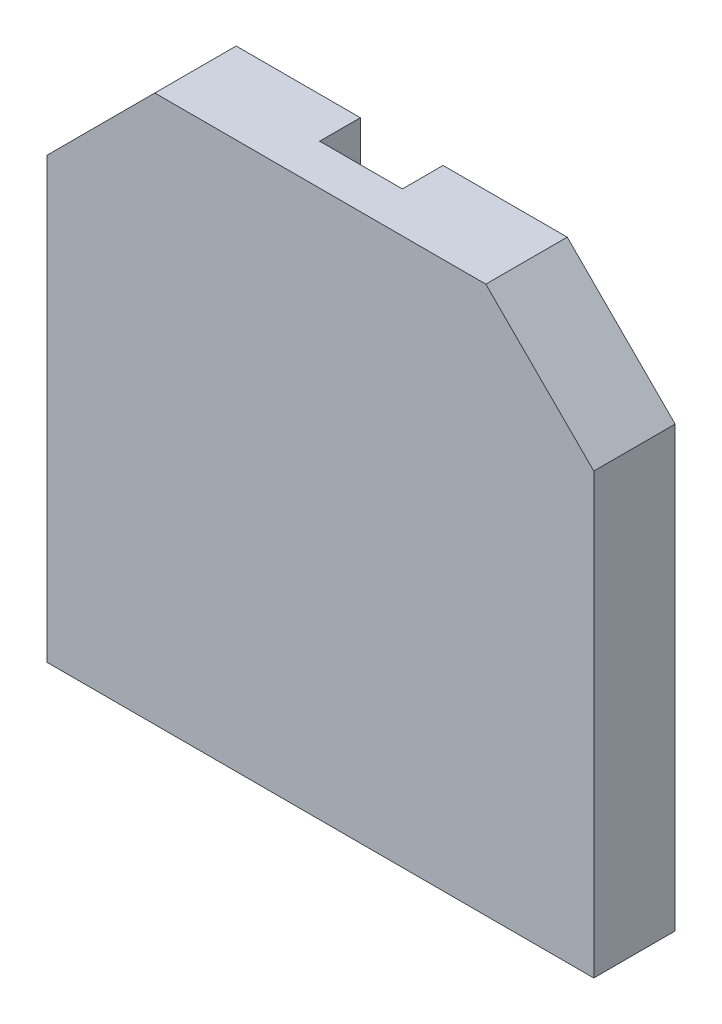
ISO-10303-21;
HEADER;
FILE_DESCRIPTION(('STEP AP214'),'2;1');
FILE_NAME('part.step','',(''),(''),'','','');
FILE_SCHEMA(('AUTOMOTIVE_DESIGN { 1 0 10303 214 1 1 1 1 }'));
ENDSEC;
DATA;
#1=APPLICATION_CONTEXT('core data for automotive mechanical design processes');
#2=APPLICATION_PROTOCOL_DEFINITION('international standard','automotive_design',2000,#1);
#3=PRODUCT_CONTEXT('',#1,'mechanical');
#4=PRODUCT('Part','Part','',(#3));
#5=PRODUCT_RELATED_PRODUCT_CATEGORY('part','',(#4));
#6=PRODUCT_DEFINITION_FORMATION('','',#4);
#7=PRODUCT_DEFINITION_CONTEXT('part definition',#1,'design');
#8=PRODUCT_DEFINITION('design','',#6,#7);
#9=PRODUCT_DEFINITION_SHAPE('','',#8);
#10=(LENGTH_UNIT() NAMED_UNIT(*) SI_UNIT(.MILLI.,.METRE.));
#11=(NAMED_UNIT(*) PLANE_ANGLE_UNIT() SI_UNIT($,.RADIAN.));
#12=(NAMED_UNIT(*) SI_UNIT($,.STERADIAN.) SOLID_ANGLE_UNIT());
#13=UNCERTAINTY_MEASURE_WITH_UNIT(LENGTH_MEASURE(1.E-05),#10,'distance_accuracy_value','');
#14=(GEOMETRIC_REPRESENTATION_CONTEXT(3) GLOBAL_UNCERTAINTY_ASSIGNED_CONTEXT((#13)) GLOBAL_UNIT_ASSIGNED_CONTEXT((#10,
#11,#12)) REPRESENTATION_CONTEXT('',''));
#15=CARTESIAN_POINT('',(0.,0.,0.));
#16=DIRECTION('',(0.,0.,1.));
#17=DIRECTION('',(1.,0.,0.));
#18=AXIS2_PLACEMENT_3D('',#15,#16,#17);
#19=CARTESIAN_POINT('',(-0.32500062,0.45719746,0.31999936));
#20=DIRECTION('',(0.,0.,-1.));
#21=DIRECTION('',(-1.,0.,0.));
#22=AXIS2_PLACEMENT_3D('',#19,#20,#21);
#23=PLANE('',#22);
#24=DIRECTION('',(0.,1.,0.));
#25=VECTOR('',#24,1.);
#26=CARTESIAN_POINT('',(0.32500062,-1.33862826,0.31999936));
#27=LINE('',#26,#25);
#28=CARTESIAN_POINT('',(0.32500062,-1.33862826,0.31999936));
#29=VERTEX_POINT('',#28);
#30=CARTESIAN_POINT('',(0.32500062,0.30719776,0.31999936));
#31=VERTEX_POINT('',#30);
#32=EDGE_CURVE('E153',#29,#31,#27,.T.);
#33=ORIENTED_EDGE('',*,*,#32,.F.);
#34=DIRECTION('',(1.,0.,0.));
#35=VECTOR('',#34,1.);
#36=CARTESIAN_POINT('',(-0.32500062,-1.33862826,0.31999936));
#37=LINE('',#36,#35);
#38=CARTESIAN_POINT('',(-0.32500062,-1.33862826,0.31999936));
#39=VERTEX_POINT('',#38);
#40=EDGE_CURVE('E151',#39,#29,#37,.T.);
#41=ORIENTED_EDGE('',*,*,#40,.F.);
#42=DIRECTION('',(0.,1.,0.));
#43=VECTOR('',#42,1.);
#44=CARTESIAN_POINT('',(-0.32500062,0.45719746,0.31999936));
#45=LINE('',#44,#43);
#46=CARTESIAN_POINT('',(-0.32500062,0.30719776,0.31999936));
#47=VERTEX_POINT('',#46);
#48=EDGE_CURVE('E146',#47,#39,#45,.F.);
#49=ORIENTED_EDGE('',*,*,#48,.F.);
#50=DIRECTION('',(-1.,0.,0.));
#51=VECTOR('',#50,1.);
#52=CARTESIAN_POINT('',(-0.32500062,0.30719776,0.31999936));
#53=LINE('',#52,#51);
#54=EDGE_CURVE('E19',#47,#31,#53,.F.);
#55=ORIENTED_EDGE('',*,*,#54,.T.);
#56=EDGE_LOOP('',(#33,#41,#49,#55));
#57=FACE_BOUND('',#56,.T.);
#58=ADVANCED_FACE('F16',(#57),#23,.T.);
#59=CARTESIAN_POINT('',(-0.32500062,-2.34697524,0.31999936));
#60=DIRECTION('',(0.,0.,-1.));
#61=DIRECTION('',(-1.,0.,0.));
#62=AXIS2_PLACEMENT_3D('',#59,#60,#61);
#63=PLANE('',#62);
#64=DIRECTION('',(0.,1.,0.));
#65=VECTOR('',#64,1.);
#66=CARTESIAN_POINT('',(-0.32500062,-2.34697524,0.31999936));
#67=LINE('',#66,#65);
#68=CARTESIAN_POINT('',(-0.32500062,-2.34697524,0.31999936));
#69=VERTEX_POINT('',#68);
#70=CARTESIAN_POINT('',(-0.32500062,-3.9928038,0.31999936));
#71=VERTEX_POINT('',#70);
#72=EDGE_CURVE('E125',#69,#71,#67,.F.);
#73=ORIENTED_EDGE('',*,*,#72,.F.);
#74=DIRECTION('',(1.,0.,0.));
#75=VECTOR('',#74,1.);
#76=CARTESIAN_POINT('',(0.32500062,-2.34697524,0.31999936));
#77=LINE('',#76,#75);
#78=CARTESIAN_POINT('',(0.32500062,-2.34697524,0.31999936));
#79=VERTEX_POINT('',#78);
#80=EDGE_CURVE('E115',#79,#69,#77,.F.);
#81=ORIENTED_EDGE('',*,*,#80,.F.);
#82=DIRECTION('',(0.,1.,0.));
#83=VECTOR('',#82,1.);
#84=CARTESIAN_POINT('',(0.32500062,-4.14280096,0.31999936));
#85=LINE('',#84,#83);
#86=CARTESIAN_POINT('',(0.32500062,-3.9928038,0.31999936));
#87=VERTEX_POINT('',#86);
#88=EDGE_CURVE('E126',#87,#79,#85,.T.);
#89=ORIENTED_EDGE('',*,*,#88,.F.);
#90=DIRECTION('',(-1.,0.,0.));
#91=VECTOR('',#90,1.);
#92=CARTESIAN_POINT('',(-0.32500062,-3.9928038,0.31999936));
#93=LINE('',#92,#91);
#94=EDGE_CURVE('E122',#87,#71,#93,.T.);
#95=ORIENTED_EDGE('',*,*,#94,.T.);
#96=EDGE_LOOP('',(#73,#81,#89,#95));
#97=FACE_BOUND('',#96,.T.);
#98=ADVANCED_FACE('F124',(#97),#63,.T.);
#99=CARTESIAN_POINT('',(0.32500062,-2.34697524,-1.00000054));
#100=DIRECTION('',(0.,-1.,0.));
#101=DIRECTION('',(0.,0.,-1.));
#102=AXIS2_PLACEMENT_3D('',#99,#100,#101);
#103=PLANE('',#102);
#104=ORIENTED_EDGE('',*,*,#80,.T.);
#105=DIRECTION('',(0.,0.,-1.));
#106=VECTOR('',#105,1.);
#107=CARTESIAN_POINT('',(-0.32500062,-2.34697524,-1.00000054));
#108=LINE('',#107,#106);
#109=CARTESIAN_POINT('',(-0.32500062,-2.34697524,0.));
#110=VERTEX_POINT('',#109);
#111=EDGE_CURVE('E134',#110,#69,#108,.F.);
#112=ORIENTED_EDGE('',*,*,#111,.F.);
#113=DIRECTION('',(-1.,0.,0.));
#114=VECTOR('',#113,1.);
#115=CARTESIAN_POINT('',(-2.15000078,-2.34697524,0.));
#116=LINE('',#115,#114);
#117=CARTESIAN_POINT('',(0.32500062,-2.34697524,0.));
#118=VERTEX_POINT('',#117);
#119=EDGE_CURVE('E166',#118,#110,#116,.T.);
#120=ORIENTED_EDGE('',*,*,#119,.F.);
#121=DIRECTION('',(0.,0.,1.));
#122=VECTOR('',#121,1.);
#123=CARTESIAN_POINT('',(0.32500062,-2.34697524,-1.00000054));
#124=LINE('',#123,#122);
#125=EDGE_CURVE('E164',#79,#118,#124,.F.);
#126=ORIENTED_EDGE('',*,*,#125,.F.);
#127=EDGE_LOOP('',(#104,#112,#120,#126));
#128=FACE_BOUND('',#127,.T.);
#129=ADVANCED_FACE('F287',(#128),#103,.T.);
#130=CARTESIAN_POINT('',(-0.32500062,-2.34697524,-1.00000054));
#131=DIRECTION('',(1.,0.,0.));
#132=DIRECTION('',(0.,0.,-1.));
#133=AXIS2_PLACEMENT_3D('',#130,#131,#132);
#134=PLANE('',#133);
#135=DIRECTION('',(0.,1.,0.));
#136=VECTOR('',#135,1.);
#137=CARTESIAN_POINT('',(-0.32500062,-0.54133242,0.));
#138=LINE('',#137,#136);
#139=CARTESIAN_POINT('',(-0.32500062,-3.9928038,0.));
#140=VERTEX_POINT('',#139);
#141=EDGE_CURVE('E168',#110,#140,#138,.F.);
#142=ORIENTED_EDGE('',*,*,#141,.F.);
#143=ORIENTED_EDGE('',*,*,#111,.T.);
#144=ORIENTED_EDGE('',*,*,#72,.T.);
#145=DIRECTION('',(0.,0.,-1.));
#146=VECTOR('',#145,1.);
#147=CARTESIAN_POINT('',(-0.32500062,-3.9928038,-1.00000054));
#148=LINE('',#147,#146);
#149=EDGE_CURVE('E132',#71,#140,#148,.T.);
#150=ORIENTED_EDGE('',*,*,#149,.T.);
#151=EDGE_LOOP('',(#142,#143,#144,#150));
#152=FACE_BOUND('',#151,.T.);
#153=ADVANCED_FACE('F131',(#152),#134,.T.);
#154=CARTESIAN_POINT('',(-0.32500062,0.45719746,-1.00000054));
#155=DIRECTION('',(1.,0.,0.));
#156=DIRECTION('',(0.,0.,-1.));
#157=AXIS2_PLACEMENT_3D('',#154,#155,#156);
#158=PLANE('',#157);
#159=ORIENTED_EDGE('',*,*,#48,.T.);
#160=DIRECTION('',(0.,0.,1.));
#161=VECTOR('',#160,1.);
#162=CARTESIAN_POINT('',(-0.32500062,-1.33862826,-1.00000054));
#163=LINE('',#162,#161);
#164=CARTESIAN_POINT('',(-0.32500062,-1.33862826,0.));
#165=VERTEX_POINT('',#164);
#166=EDGE_CURVE('E148',#165,#39,#163,.T.);
#167=ORIENTED_EDGE('',*,*,#166,.F.);
#168=DIRECTION('',(0.,1.,0.));
#169=VECTOR('',#168,1.);
#170=CARTESIAN_POINT('',(-0.32500062,-0.54133242,0.));
#171=LINE('',#170,#169);
#172=CARTESIAN_POINT('',(-0.32500062,0.30719776,0.));
#173=VERTEX_POINT('',#172);
#174=EDGE_CURVE('E170',#173,#165,#171,.F.);
#175=ORIENTED_EDGE('',*,*,#174,.F.);
#176=DIRECTION('',(0.,0.,-1.));
#177=VECTOR('',#176,1.);
#178=CARTESIAN_POINT('',(-0.32500062,0.30719776,-1.00000054));
#179=LINE('',#178,#177);
#180=EDGE_CURVE('E141',#173,#47,#179,.F.);
#181=ORIENTED_EDGE('',*,*,#180,.T.);
#182=EDGE_LOOP('',(#159,#167,#175,#181));
#183=FACE_BOUND('',#182,.T.);
#184=ADVANCED_FACE('F280',(#183),#158,.T.);
#185=CARTESIAN_POINT('',(-0.32500062,-1.33862826,-1.00000054));
#186=DIRECTION('',(0.,1.,0.));
#187=DIRECTION('',(0.,0.,1.));
#188=AXIS2_PLACEMENT_3D('',#185,#186,#187);
#189=PLANE('',#188);
#190=ORIENTED_EDGE('',*,*,#40,.T.);
#191=DIRECTION('',(0.,0.,1.));
#192=VECTOR('',#191,1.);
#193=CARTESIAN_POINT('',(0.32500062,-1.33862826,-1.00000054));
#194=LINE('',#193,#192);
#195=CARTESIAN_POINT('',(0.32500062,-1.33862826,0.));
#196=VERTEX_POINT('',#195);
#197=EDGE_CURVE('E158',#196,#29,#194,.T.);
#198=ORIENTED_EDGE('',*,*,#197,.F.);
#199=DIRECTION('',(-1.,0.,0.));
#200=VECTOR('',#199,1.);
#201=CARTESIAN_POINT('',(-2.15000078,-1.33862826,0.));
#202=LINE('',#201,#200);
#203=EDGE_CURVE('E172',#165,#196,#202,.F.);
#204=ORIENTED_EDGE('',*,*,#203,.F.);
#205=ORIENTED_EDGE('',*,*,#166,.T.);
#206=EDGE_LOOP('',(#190,#198,#204,#205));
#207=FACE_BOUND('',#206,.T.);
#208=ADVANCED_FACE('F276',(#207),#189,.T.);
#209=CARTESIAN_POINT('',(0.32500062,-1.33862826,-1.00000054));
#210=DIRECTION('',(-1.,0.,0.));
#211=DIRECTION('',(0.,0.,1.));
#212=AXIS2_PLACEMENT_3D('',#209,#210,#211);
#213=PLANE('',#212);
#214=DIRECTION('',(0.,1.,0.));
#215=VECTOR('',#214,1.);
#216=CARTESIAN_POINT('',(0.32500062,-0.54133242,0.));
#217=LINE('',#216,#215);
#218=CARTESIAN_POINT('',(0.32500062,0.30719776,0.));
#219=VERTEX_POINT('',#218);
#220=EDGE_CURVE('E174',#196,#219,#217,.T.);
#221=ORIENTED_EDGE('',*,*,#220,.F.);
#222=ORIENTED_EDGE('',*,*,#197,.T.);
#223=ORIENTED_EDGE('',*,*,#32,.T.);
#224=DIRECTION('',(0.,0.,1.));
#225=VECTOR('',#224,1.);
#226=CARTESIAN_POINT('',(0.32500062,0.30719776,-1.00000054));
#227=LINE('',#226,#225);
#228=EDGE_CURVE('E156',#31,#219,#227,.F.);
#229=ORIENTED_EDGE('',*,*,#228,.T.);
#230=EDGE_LOOP('',(#221,#222,#223,#229));
#231=FACE_BOUND('',#230,.T.);
#232=ADVANCED_FACE('F272',(#231),#213,.T.);
#233=CARTESIAN_POINT('',(0.32500062,-4.14280096,-1.00000054));
#234=DIRECTION('',(-1.,0.,0.));
#235=DIRECTION('',(0.,0.,1.));
#236=AXIS2_PLACEMENT_3D('',#233,#234,#235);
#237=PLANE('',#236);
#238=ORIENTED_EDGE('',*,*,#88,.T.);
#239=ORIENTED_EDGE('',*,*,#125,.T.);
#240=DIRECTION('',(0.,1.,0.));
#241=VECTOR('',#240,1.);
#242=CARTESIAN_POINT('',(0.32500062,-0.54133242,0.));
#243=LINE('',#242,#241);
#244=CARTESIAN_POINT('',(0.32500062,-3.9928038,0.));
#245=VERTEX_POINT('',#244);
#246=EDGE_CURVE('E177',#245,#118,#243,.T.);
#247=ORIENTED_EDGE('',*,*,#246,.F.);
#248=DIRECTION('',(0.,0.,1.));
#249=VECTOR('',#248,1.);
#250=CARTESIAN_POINT('',(0.32500062,-3.9928038,-1.00000054));
#251=LINE('',#250,#249);
#252=EDGE_CURVE('E161',#245,#87,#251,.T.);
#253=ORIENTED_EDGE('',*,*,#252,.T.);
#254=EDGE_LOOP('',(#238,#239,#247,#253));
#255=FACE_BOUND('',#254,.T.);
#256=ADVANCED_FACE('F268',(#255),#237,.T.);
#257=CARTESIAN_POINT('',(-2.15000078,-0.54133242,0.));
#258=DIRECTION('',(0.,0.,-1.));
#259=DIRECTION('',(-1.,0.,0.));
#260=AXIS2_PLACEMENT_3D('',#257,#258,#259);
#261=PLANE('',#260);
#262=DIRECTION('',(1.,0.,0.));
#263=VECTOR('',#262,1.);
#264=CARTESIAN_POINT('',(-2.15000078,-3.9928038,0.));
#265=LINE('',#264,#263);
#266=CARTESIAN_POINT('',(2.15000078,-3.9928038,0.));
#267=VERTEX_POINT('',#266);
#268=EDGE_CURVE('E205',#267,#245,#265,.F.);
#269=ORIENTED_EDGE('',*,*,#268,.T.);
#270=ORIENTED_EDGE('',*,*,#246,.T.);
#271=ORIENTED_EDGE('',*,*,#119,.T.);
#272=ORIENTED_EDGE('',*,*,#141,.T.);
#273=DIRECTION('',(1.,0.,0.));
#274=VECTOR('',#273,1.);
#275=CARTESIAN_POINT('',(-2.15000078,-3.9928038,0.));
#276=LINE('',#275,#274);
#277=CARTESIAN_POINT('',(-2.15000078,-3.9928038,0.));
#278=VERTEX_POINT('',#277);
#279=EDGE_CURVE('E139',#140,#278,#276,.F.);
#280=ORIENTED_EDGE('',*,*,#279,.T.);
#281=DIRECTION('',(0.,1.,0.));
#282=VECTOR('',#281,1.);
#283=CARTESIAN_POINT('',(-2.15000078,-0.54133242,0.));
#284=LINE('',#283,#282);
#285=CARTESIAN_POINT('',(-2.15000078,-0.54133242,0.));
#286=VERTEX_POINT('',#285);
#287=EDGE_CURVE('E212',#278,#286,#284,.T.);
#288=ORIENTED_EDGE('',*,*,#287,.T.);
#289=DIRECTION('',(0.707106781186548,0.707106781186548,0.));
#290=VECTOR('',#289,1.);
#291=CARTESIAN_POINT('',(-1.3014706,0.30719776,0.));
#292=LINE('',#291,#290);
#293=CARTESIAN_POINT('',(-1.3014706,0.30719776,0.));
#294=VERTEX_POINT('',#293);
#295=EDGE_CURVE('E180',#286,#294,#292,.T.);
#296=ORIENTED_EDGE('',*,*,#295,.T.);
#297=DIRECTION('',(1.,0.,0.));
#298=VECTOR('',#297,1.);
#299=CARTESIAN_POINT('',(1.3014706,0.30719776,0.));
#300=LINE('',#299,#298);
#301=EDGE_CURVE('E183',#294,#173,#300,.T.);
#302=ORIENTED_EDGE('',*,*,#301,.T.);
#303=ORIENTED_EDGE('',*,*,#174,.T.);
#304=ORIENTED_EDGE('',*,*,#203,.T.);
#305=ORIENTED_EDGE('',*,*,#220,.T.);
#306=DIRECTION('',(1.,0.,0.));
#307=VECTOR('',#306,1.);
#308=CARTESIAN_POINT('',(1.3014706,0.30719776,0.));
#309=LINE('',#308,#307);
#310=CARTESIAN_POINT('',(1.3014706,0.30719776,0.));
#311=VERTEX_POINT('',#310);
#312=EDGE_CURVE('E186',#219,#311,#309,.T.);
#313=ORIENTED_EDGE('',*,*,#312,.T.);
#314=DIRECTION('',(0.707106781186548,-0.707106781186548,0.));
#315=VECTOR('',#314,1.);
#316=CARTESIAN_POINT('',(2.15000078,-0.54133242,0.));
#317=LINE('',#316,#315);
#318=CARTESIAN_POINT('',(2.15000078,-0.54133242,0.));
#319=VERTEX_POINT('',#318);
#320=EDGE_CURVE('E194',#311,#319,#317,.T.);
#321=ORIENTED_EDGE('',*,*,#320,.T.);
#322=DIRECTION('',(0.,1.,0.));
#323=VECTOR('',#322,1.);
#324=CARTESIAN_POINT('',(2.15000078,-3.9928038,0.));
#325=LINE('',#324,#323);
#326=EDGE_CURVE('E199',#319,#267,#325,.F.);
#327=ORIENTED_EDGE('',*,*,#326,.T.);
#328=EDGE_LOOP('',(#269,#270,#271,#272,#280,#288,#296,#302,#303,#304,#305,#313,#321,#327));
#329=FACE_BOUND('',#328,.T.);
#330=ADVANCED_FACE('F265',(#329),#261,.T.);
#331=CARTESIAN_POINT('',(-1.3014706,0.30719776,0.));
#332=DIRECTION('',(0.707106781186548,-0.707106781186548,0.));
#333=DIRECTION('',(0.707106781186548,0.707106781186548,0.));
#334=AXIS2_PLACEMENT_3D('',#331,#332,#333);
#335=PLANE('',#334);
#336=DIRECTION('',(0.,0.,-1.));
#337=VECTOR('',#336,1.);
#338=CARTESIAN_POINT('',(-2.15000078,-0.54133242,0.));
#339=LINE('',#338,#337);
#340=CARTESIAN_POINT('',(-2.15000078,-0.54133242,0.64000126));
#341=VERTEX_POINT('',#340);
#342=EDGE_CURVE('E208',#286,#341,#339,.F.);
#343=ORIENTED_EDGE('',*,*,#342,.T.);
#344=DIRECTION('',(0.707106781186547,0.707106781186548,0.));
#345=VECTOR('',#344,1.);
#346=CARTESIAN_POINT('',(-2.15000078,-0.54133242,0.64000126));
#347=LINE('',#346,#345);
#348=CARTESIAN_POINT('',(-1.3014706,0.30719776,0.64000126));
#349=VERTEX_POINT('',#348);
#350=EDGE_CURVE('E215',#341,#349,#347,.T.);
#351=ORIENTED_EDGE('',*,*,#350,.T.);
#352=DIRECTION('',(0.,0.,-1.));
#353=VECTOR('',#352,1.);
#354=CARTESIAN_POINT('',(-1.3014706,0.30719776,0.));
#355=LINE('',#354,#353);
#356=EDGE_CURVE('E188',#349,#294,#355,.T.);
#357=ORIENTED_EDGE('',*,*,#356,.T.);
#358=ORIENTED_EDGE('',*,*,#295,.F.);
#359=EDGE_LOOP('',(#343,#351,#357,#358));
#360=FACE_BOUND('',#359,.T.);
#361=ADVANCED_FACE('F244',(#360),#335,.F.);
#362=CARTESIAN_POINT('',(1.3014706,0.30719776,0.));
#363=DIRECTION('',(0.,-1.,0.));
#364=DIRECTION('',(0.,0.,-1.));
#365=AXIS2_PLACEMENT_3D('',#362,#363,#364);
#366=PLANE('',#365);
#367=DIRECTION('',(-1.,0.,0.));
#368=VECTOR('',#367,1.);
#369=CARTESIAN_POINT('',(-2.15000078,0.30719776,0.64000126));
#370=LINE('',#369,#368);
#371=CARTESIAN_POINT('',(1.3014706,0.30719776,0.64000126));
#372=VERTEX_POINT('',#371);
#373=EDGE_CURVE('E218',#349,#372,#370,.F.);
#374=ORIENTED_EDGE('',*,*,#373,.T.);
#375=DIRECTION('',(0.,0.,1.));
#376=VECTOR('',#375,1.);
#377=CARTESIAN_POINT('',(1.3014706,0.30719776,0.));
#378=LINE('',#377,#376);
#379=EDGE_CURVE('E191',#372,#311,#378,.F.);
#380=ORIENTED_EDGE('',*,*,#379,.T.);
#381=ORIENTED_EDGE('',*,*,#312,.F.);
#382=ORIENTED_EDGE('',*,*,#228,.F.);
#383=ORIENTED_EDGE('',*,*,#54,.F.);
#384=ORIENTED_EDGE('',*,*,#180,.F.);
#385=ORIENTED_EDGE('',*,*,#301,.F.);
#386=ORIENTED_EDGE('',*,*,#356,.F.);
#387=EDGE_LOOP('',(#374,#380,#381,#382,#383,#384,#385,#386));
#388=FACE_BOUND('',#387,.T.);
#389=ADVANCED_FACE('F241',(#388),#366,.F.);
#390=CARTESIAN_POINT('',(2.15000078,-0.54133242,0.));
#391=DIRECTION('',(-0.707106781186548,-0.707106781186548,0.));
#392=DIRECTION('',(0.707106781186548,-0.707106781186548,0.));
#393=AXIS2_PLACEMENT_3D('',#390,#391,#392);
#394=PLANE('',#393);
#395=ORIENTED_EDGE('',*,*,#379,.F.);
#396=DIRECTION('',(0.707106781186547,-0.707106781186548,0.));
#397=VECTOR('',#396,1.);
#398=CARTESIAN_POINT('',(1.3014706,0.30719776,0.64000126));
#399=LINE('',#398,#397);
#400=CARTESIAN_POINT('',(2.15000078,-0.54133242,0.64000126));
#401=VERTEX_POINT('',#400);
#402=EDGE_CURVE('E221',#372,#401,#399,.T.);
#403=ORIENTED_EDGE('',*,*,#402,.T.);
#404=DIRECTION('',(0.,0.,1.));
#405=VECTOR('',#404,1.);
#406=CARTESIAN_POINT('',(2.15000078,-0.54133242,0.));
#407=LINE('',#406,#405);
#408=EDGE_CURVE('E196',#401,#319,#407,.F.);
#409=ORIENTED_EDGE('',*,*,#408,.T.);
#410=ORIENTED_EDGE('',*,*,#320,.F.);
#411=EDGE_LOOP('',(#395,#403,#409,#410));
#412=FACE_BOUND('',#411,.T.);
#413=ADVANCED_FACE('F238',(#412),#394,.F.);
#414=CARTESIAN_POINT('',(2.15000078,-3.9928038,0.));
#415=DIRECTION('',(-1.,0.,0.));
#416=DIRECTION('',(0.,0.,1.));
#417=AXIS2_PLACEMENT_3D('',#414,#415,#416);
#418=PLANE('',#417);
#419=ORIENTED_EDGE('',*,*,#408,.F.);
#420=DIRECTION('',(0.,1.,0.));
#421=VECTOR('',#420,1.);
#422=CARTESIAN_POINT('',(2.15000078,-0.54133242,0.64000126));
#423=LINE('',#422,#421);
#424=CARTESIAN_POINT('',(2.15000078,-3.9928038,0.64000126));
#425=VERTEX_POINT('',#424);
#426=EDGE_CURVE('E224',#401,#425,#423,.F.);
#427=ORIENTED_EDGE('',*,*,#426,.T.);
#428=DIRECTION('',(0.,0.,1.));
#429=VECTOR('',#428,1.);
#430=CARTESIAN_POINT('',(2.15000078,-3.9928038,0.));
#431=LINE('',#430,#429);
#432=EDGE_CURVE('E202',#425,#267,#431,.F.);
#433=ORIENTED_EDGE('',*,*,#432,.T.);
#434=ORIENTED_EDGE('',*,*,#326,.F.);
#435=EDGE_LOOP('',(#419,#427,#433,#434));
#436=FACE_BOUND('',#435,.T.);
#437=ADVANCED_FACE('F234',(#436),#418,.F.);
#438=CARTESIAN_POINT('',(-2.15000078,-3.9928038,0.));
#439=DIRECTION('',(0.,1.,0.));
#440=DIRECTION('',(0.,0.,1.));
#441=AXIS2_PLACEMENT_3D('',#438,#439,#440);
#442=PLANE('',#441);
#443=ORIENTED_EDGE('',*,*,#268,.F.);
#444=ORIENTED_EDGE('',*,*,#432,.F.);
#445=DIRECTION('',(-1.,0.,0.));
#446=VECTOR('',#445,1.);
#447=CARTESIAN_POINT('',(-2.15000078,-3.9928038,0.64000126));
#448=LINE('',#447,#446);
#449=CARTESIAN_POINT('',(-2.15000078,-3.9928038,0.64000126));
#450=VERTEX_POINT('',#449);
#451=EDGE_CURVE('E25',#425,#450,#448,.T.);
#452=ORIENTED_EDGE('',*,*,#451,.T.);
#453=DIRECTION('',(0.,0.,-1.));
#454=VECTOR('',#453,1.);
#455=CARTESIAN_POINT('',(-2.15000078,-3.9928038,0.));
#456=LINE('',#455,#454);
#457=EDGE_CURVE('E33',#450,#278,#456,.T.);
#458=ORIENTED_EDGE('',*,*,#457,.T.);
#459=ORIENTED_EDGE('',*,*,#279,.F.);
#460=ORIENTED_EDGE('',*,*,#149,.F.);
#461=ORIENTED_EDGE('',*,*,#94,.F.);
#462=ORIENTED_EDGE('',*,*,#252,.F.);
#463=EDGE_LOOP('',(#443,#444,#452,#458,#459,#460,#461,#462));
#464=FACE_BOUND('',#463,.T.);
#465=ADVANCED_FACE('F138',(#464),#442,.F.);
#466=CARTESIAN_POINT('',(-2.15000078,-0.54133242,0.));
#467=DIRECTION('',(1.,0.,0.));
#468=DIRECTION('',(0.,0.,-1.));
#469=AXIS2_PLACEMENT_3D('',#466,#467,#468);
#470=PLANE('',#469);
#471=ORIENTED_EDGE('',*,*,#457,.F.);
#472=DIRECTION('',(0.,1.,0.));
#473=VECTOR('',#472,1.);
#474=CARTESIAN_POINT('',(-2.15000078,-0.54133242,0.64000126));
#475=LINE('',#474,#473);
#476=EDGE_CURVE('E11',#450,#341,#475,.T.);
#477=ORIENTED_EDGE('',*,*,#476,.T.);
#478=ORIENTED_EDGE('',*,*,#342,.F.);
#479=ORIENTED_EDGE('',*,*,#287,.F.);
#480=EDGE_LOOP('',(#471,#477,#478,#479));
#481=FACE_BOUND('',#480,.T.);
#482=ADVANCED_FACE('F246',(#481),#470,.F.);
#483=CARTESIAN_POINT('',(-2.15000078,-0.54133242,0.64000126));
#484=DIRECTION('',(0.,0.,-1.));
#485=DIRECTION('',(-1.,0.,0.));
#486=AXIS2_PLACEMENT_3D('',#483,#484,#485);
#487=PLANE('',#486);
#488=ORIENTED_EDGE('',*,*,#451,.F.);
#489=ORIENTED_EDGE('',*,*,#426,.F.);
#490=ORIENTED_EDGE('',*,*,#402,.F.);
#491=ORIENTED_EDGE('',*,*,#373,.F.);
#492=ORIENTED_EDGE('',*,*,#350,.F.);
#493=ORIENTED_EDGE('',*,*,#476,.F.);
#494=EDGE_LOOP('',(#488,#489,#490,#491,#492,#493));
#495=FACE_BOUND('',#494,.T.);
#496=ADVANCED_FACE('F231',(#495),#487,.F.);
#497=CLOSED_SHELL('',(#58,#98,#129,#153,#184,#208,#232,#256,#330,#361,#389,#413,#437,#465,#482,#496));
#498=MANIFOLD_SOLID_BREP('B1',#497);
#499=ADVANCED_BREP_SHAPE_REPRESENTATION('',(#18,#498),#14);
#500=SHAPE_DEFINITION_REPRESENTATION(#9,#499);
ENDSEC;
END-ISO-10303-21;
